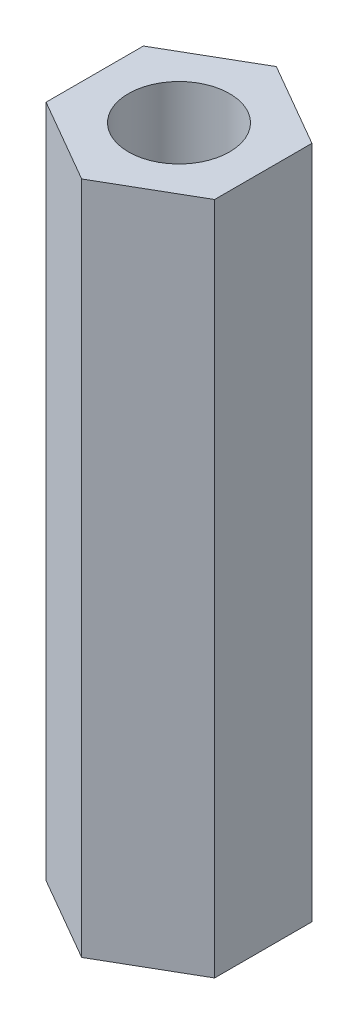
ISO-10303-21;
HEADER;
FILE_DESCRIPTION(('STEP AP214'),'2;1');
FILE_NAME('part.step','',(''),(''),'','','');
FILE_SCHEMA(('AUTOMOTIVE_DESIGN { 1 0 10303 214 1 1 1 1 }'));
ENDSEC;
DATA;
#1=APPLICATION_CONTEXT('core data for automotive mechanical design processes');
#2=APPLICATION_PROTOCOL_DEFINITION('international standard','automotive_design',2000,#1);
#3=PRODUCT_CONTEXT('',#1,'mechanical');
#4=PRODUCT('Part','Part','',(#3));
#5=PRODUCT_RELATED_PRODUCT_CATEGORY('part','',(#4));
#6=PRODUCT_DEFINITION_FORMATION('','',#4);
#7=PRODUCT_DEFINITION_CONTEXT('part definition',#1,'design');
#8=PRODUCT_DEFINITION('design','',#6,#7);
#9=PRODUCT_DEFINITION_SHAPE('','',#8);
#10=(LENGTH_UNIT() NAMED_UNIT(*) SI_UNIT(.MILLI.,.METRE.));
#11=(NAMED_UNIT(*) PLANE_ANGLE_UNIT() SI_UNIT($,.RADIAN.));
#12=(NAMED_UNIT(*) SI_UNIT($,.STERADIAN.) SOLID_ANGLE_UNIT());
#13=UNCERTAINTY_MEASURE_WITH_UNIT(LENGTH_MEASURE(1.E-05),#10,'distance_accuracy_value','');
#14=(GEOMETRIC_REPRESENTATION_CONTEXT(3) GLOBAL_UNCERTAINTY_ASSIGNED_CONTEXT((#13)) GLOBAL_UNIT_ASSIGNED_CONTEXT((#10,
#11,#12)) REPRESENTATION_CONTEXT('',''));
#15=CARTESIAN_POINT('',(0.,0.,0.));
#16=DIRECTION('',(0.,0.,1.));
#17=DIRECTION('',(1.,0.,0.));
#18=AXIS2_PLACEMENT_3D('',#15,#16,#17);
#19=CARTESIAN_POINT('',(-4.99999999999997,40.,2.88675134594819));
#20=DIRECTION('',(0.499999999999995,0.,-0.866025403784442));
#21=DIRECTION('',(-0.866025403784442,0.,-0.499999999999995));
#22=AXIS2_PLACEMENT_3D('',#19,#20,#21);
#23=PLANE('',#22);
#24=DIRECTION('',(0.866025403784442,0.,0.499999999999995));
#25=VECTOR('',#24,1.);
#26=CARTESIAN_POINT('',(-4.99999999999997,0.,2.88675134594819));
#27=LINE('',#26,#25);
#28=CARTESIAN_POINT('',(-4.99999999999997,0.,2.88675134594819));
#29=VERTEX_POINT('',#28);
#30=CARTESIAN_POINT('',(0.,0.,5.77350269189626));
#31=VERTEX_POINT('',#30);
#32=EDGE_CURVE('E117',#29,#31,#27,.T.);
#33=ORIENTED_EDGE('',*,*,#32,.T.);
#34=DIRECTION('',(0.,-1.,0.));
#35=VECTOR('',#34,1.);
#36=CARTESIAN_POINT('',(0.,40.,5.77350269189626));
#37=LINE('',#36,#35);
#38=CARTESIAN_POINT('',(0.,40.,5.77350269189626));
#39=VERTEX_POINT('',#38);
#40=EDGE_CURVE('E11',#39,#31,#37,.T.);
#41=ORIENTED_EDGE('',*,*,#40,.F.);
#42=DIRECTION('',(0.866025403784442,0.,0.499999999999995));
#43=VECTOR('',#42,1.);
#44=CARTESIAN_POINT('',(-4.99999999999997,40.,2.88675134594819));
#45=LINE('',#44,#43);
#46=CARTESIAN_POINT('',(-4.99999999999997,40.,2.88675134594819));
#47=VERTEX_POINT('',#46);
#48=EDGE_CURVE('E128',#47,#39,#45,.T.);
#49=ORIENTED_EDGE('',*,*,#48,.F.);
#50=DIRECTION('',(0.,-1.,0.));
#51=VECTOR('',#50,1.);
#52=CARTESIAN_POINT('',(-4.99999999999997,40.,2.88675134594819));
#53=LINE('',#52,#51);
#54=EDGE_CURVE('E113',#47,#29,#53,.T.);
#55=ORIENTED_EDGE('',*,*,#54,.T.);
#56=EDGE_LOOP('',(#33,#41,#49,#55));
#57=FACE_BOUND('',#56,.T.);
#58=ADVANCED_FACE('F33',(#57),#23,.F.);
#59=CARTESIAN_POINT('',(0.,40.,5.77350269189626));
#60=DIRECTION('',(-0.500000000000001,0.,-0.866025403784438));
#61=DIRECTION('',(-0.866025403784438,0.,0.500000000000001));
#62=AXIS2_PLACEMENT_3D('',#59,#60,#61);
#63=PLANE('',#62);
#64=DIRECTION('',(0.866025403784438,0.,-0.500000000000001));
#65=VECTOR('',#64,1.);
#66=CARTESIAN_POINT('',(0.,0.,5.77350269189626));
#67=LINE('',#66,#65);
#68=CARTESIAN_POINT('',(5.00000000000001,0.,2.88675134594812));
#69=VERTEX_POINT('',#68);
#70=EDGE_CURVE('E120',#31,#69,#67,.T.);
#71=ORIENTED_EDGE('',*,*,#70,.T.);
#72=DIRECTION('',(0.,-1.,0.));
#73=VECTOR('',#72,1.);
#74=CARTESIAN_POINT('',(5.00000000000001,40.,2.88675134594812));
#75=LINE('',#74,#73);
#76=CARTESIAN_POINT('',(5.00000000000001,40.,2.88675134594812));
#77=VERTEX_POINT('',#76);
#78=EDGE_CURVE('E41',#77,#69,#75,.T.);
#79=ORIENTED_EDGE('',*,*,#78,.F.);
#80=DIRECTION('',(0.866025403784438,0.,-0.500000000000001));
#81=VECTOR('',#80,1.);
#82=CARTESIAN_POINT('',(0.,40.,5.77350269189626));
#83=LINE('',#82,#81);
#84=EDGE_CURVE('E86',#39,#77,#83,.T.);
#85=ORIENTED_EDGE('',*,*,#84,.F.);
#86=ORIENTED_EDGE('',*,*,#40,.T.);
#87=EDGE_LOOP('',(#71,#79,#85,#86));
#88=FACE_BOUND('',#87,.T.);
#89=ADVANCED_FACE('F153',(#88),#63,.F.);
#90=CARTESIAN_POINT('',(5.00000000000001,40.,2.88675134594812));
#91=DIRECTION('',(-1.,0.,0.));
#92=DIRECTION('',(0.,0.,1.));
#93=AXIS2_PLACEMENT_3D('',#90,#91,#92);
#94=PLANE('',#93);
#95=DIRECTION('',(0.,0.,-1.));
#96=VECTOR('',#95,1.);
#97=CARTESIAN_POINT('',(5.00000000000001,0.,2.88675134594812));
#98=LINE('',#97,#96);
#99=CARTESIAN_POINT('',(4.99999999999999,0.,-2.88675134594815));
#100=VERTEX_POINT('',#99);
#101=EDGE_CURVE('E123',#69,#100,#98,.T.);
#102=ORIENTED_EDGE('',*,*,#101,.T.);
#103=DIRECTION('',(0.,-1.,0.));
#104=VECTOR('',#103,1.);
#105=CARTESIAN_POINT('',(4.99999999999999,40.,-2.88675134594815));
#106=LINE('',#105,#104);
#107=CARTESIAN_POINT('',(4.99999999999999,40.,-2.88675134594815));
#108=VERTEX_POINT('',#107);
#109=EDGE_CURVE('E108',#108,#100,#106,.T.);
#110=ORIENTED_EDGE('',*,*,#109,.F.);
#111=DIRECTION('',(0.,0.,-1.));
#112=VECTOR('',#111,1.);
#113=CARTESIAN_POINT('',(5.00000000000001,40.,2.88675134594812));
#114=LINE('',#113,#112);
#115=EDGE_CURVE('E99',#77,#108,#114,.T.);
#116=ORIENTED_EDGE('',*,*,#115,.F.);
#117=ORIENTED_EDGE('',*,*,#78,.T.);
#118=EDGE_LOOP('',(#102,#110,#116,#117));
#119=FACE_BOUND('',#118,.T.);
#120=ADVANCED_FACE('F134',(#119),#94,.F.);
#121=CARTESIAN_POINT('',(4.99999999999999,40.,-2.88675134594815));
#122=DIRECTION('',(-0.499999999999995,0.,0.866025403784442));
#123=DIRECTION('',(0.866025403784442,0.,0.499999999999995));
#124=AXIS2_PLACEMENT_3D('',#121,#122,#123);
#125=PLANE('',#124);
#126=DIRECTION('',(-0.866025403784441,0.,-0.499999999999995));
#127=VECTOR('',#126,1.);
#128=CARTESIAN_POINT('',(4.99999999999999,0.,-2.88675134594815));
#129=LINE('',#128,#127);
#130=CARTESIAN_POINT('',(0.,0.,-5.77350269189626));
#131=VERTEX_POINT('',#130);
#132=EDGE_CURVE('E107',#100,#131,#129,.T.);
#133=ORIENTED_EDGE('',*,*,#132,.T.);
#134=DIRECTION('',(0.,-1.,0.));
#135=VECTOR('',#134,1.);
#136=CARTESIAN_POINT('',(0.,40.,-5.77350269189626));
#137=LINE('',#136,#135);
#138=CARTESIAN_POINT('',(0.,40.,-5.77350269189626));
#139=VERTEX_POINT('',#138);
#140=EDGE_CURVE('E104',#139,#131,#137,.T.);
#141=ORIENTED_EDGE('',*,*,#140,.F.);
#142=DIRECTION('',(-0.866025403784441,0.,-0.499999999999995));
#143=VECTOR('',#142,1.);
#144=CARTESIAN_POINT('',(4.99999999999999,40.,-2.88675134594815));
#145=LINE('',#144,#143);
#146=EDGE_CURVE('E93',#108,#139,#145,.T.);
#147=ORIENTED_EDGE('',*,*,#146,.F.);
#148=ORIENTED_EDGE('',*,*,#109,.T.);
#149=EDGE_LOOP('',(#133,#141,#147,#148));
#150=FACE_BOUND('',#149,.T.);
#151=ADVANCED_FACE('F105',(#150),#125,.F.);
#152=CARTESIAN_POINT('',(0.,40.,-5.77350269189626));
#153=DIRECTION('',(0.500000000000007,0.,0.866025403784435));
#154=DIRECTION('',(0.866025403784435,0.,-0.500000000000007));
#155=AXIS2_PLACEMENT_3D('',#152,#153,#154);
#156=PLANE('',#155);
#157=DIRECTION('',(-0.866025403784434,0.,0.500000000000007));
#158=VECTOR('',#157,1.);
#159=CARTESIAN_POINT('',(0.,0.,-5.77350269189626));
#160=LINE('',#159,#158);
#161=CARTESIAN_POINT('',(-5.00000000000003,0.,-2.88675134594808));
#162=VERTEX_POINT('',#161);
#163=EDGE_CURVE('E72',#131,#162,#160,.T.);
#164=ORIENTED_EDGE('',*,*,#163,.T.);
#165=DIRECTION('',(0.,-1.,0.));
#166=VECTOR('',#165,1.);
#167=CARTESIAN_POINT('',(-5.00000000000003,40.,-2.88675134594808));
#168=LINE('',#167,#166);
#169=CARTESIAN_POINT('',(-5.00000000000003,40.,-2.88675134594808));
#170=VERTEX_POINT('',#169);
#171=EDGE_CURVE('E109',#170,#162,#168,.T.);
#172=ORIENTED_EDGE('',*,*,#171,.F.);
#173=DIRECTION('',(-0.866025403784434,0.,0.500000000000007));
#174=VECTOR('',#173,1.);
#175=CARTESIAN_POINT('',(0.,40.,-5.77350269189626));
#176=LINE('',#175,#174);
#177=EDGE_CURVE('E97',#139,#170,#176,.T.);
#178=ORIENTED_EDGE('',*,*,#177,.F.);
#179=ORIENTED_EDGE('',*,*,#140,.T.);
#180=EDGE_LOOP('',(#164,#172,#178,#179));
#181=FACE_BOUND('',#180,.T.);
#182=ADVANCED_FACE('F111',(#181),#156,.F.);
#183=CARTESIAN_POINT('',(-5.00000000000003,40.,-2.88675134594808));
#184=DIRECTION('',(1.,0.,0.));
#185=DIRECTION('',(0.,0.,-1.));
#186=AXIS2_PLACEMENT_3D('',#183,#184,#185);
#187=PLANE('',#186);
#188=DIRECTION('',(0.,0.,1.));
#189=VECTOR('',#188,1.);
#190=CARTESIAN_POINT('',(-5.00000000000003,0.,-2.88675134594808));
#191=LINE('',#190,#189);
#192=EDGE_CURVE('E78',#162,#29,#191,.T.);
#193=ORIENTED_EDGE('',*,*,#192,.T.);
#194=ORIENTED_EDGE('',*,*,#54,.F.);
#195=DIRECTION('',(0.,0.,1.));
#196=VECTOR('',#195,1.);
#197=CARTESIAN_POINT('',(-5.00000000000003,40.,-2.88675134594808));
#198=LINE('',#197,#196);
#199=EDGE_CURVE('E49',#170,#47,#198,.T.);
#200=ORIENTED_EDGE('',*,*,#199,.F.);
#201=ORIENTED_EDGE('',*,*,#171,.T.);
#202=EDGE_LOOP('',(#193,#194,#200,#201));
#203=FACE_BOUND('',#202,.T.);
#204=ADVANCED_FACE('F141',(#203),#187,.F.);
#205=CARTESIAN_POINT('',(0.,40.,0.));
#206=DIRECTION('',(0.,1.,0.));
#207=DIRECTION('',(0.,0.,1.));
#208=AXIS2_PLACEMENT_3D('',#205,#206,#207);
#209=PLANE('',#208);
#210=CARTESIAN_POINT('',(0.,40.,0.));
#211=DIRECTION('',(0.,1.,0.));
#212=DIRECTION('',(0.,0.,1.));
#213=AXIS2_PLACEMENT_3D('',#210,#211,#212);
#214=CIRCLE('',#213,3.);
#215=CARTESIAN_POINT('',(0.,40.,3.));
#216=VERTEX_POINT('',#215);
#217=EDGE_CURVE('E237',#216,#216,#214,.T.);
#218=ORIENTED_EDGE('',*,*,#217,.F.);
#219=EDGE_LOOP('',(#218));
#220=FACE_BOUND('',#219,.T.);
#221=ORIENTED_EDGE('',*,*,#48,.T.);
#222=ORIENTED_EDGE('',*,*,#84,.T.);
#223=ORIENTED_EDGE('',*,*,#115,.T.);
#224=ORIENTED_EDGE('',*,*,#146,.T.);
#225=ORIENTED_EDGE('',*,*,#177,.T.);
#226=ORIENTED_EDGE('',*,*,#199,.T.);
#227=EDGE_LOOP('',(#221,#222,#223,#224,#225,#226));
#228=FACE_BOUND('',#227,.T.);
#229=ADVANCED_FACE('F95',(#220,#228),#209,.T.);
#230=CARTESIAN_POINT('',(0.,0.,0.));
#231=DIRECTION('',(0.,1.,0.));
#232=DIRECTION('',(0.,0.,1.));
#233=AXIS2_PLACEMENT_3D('',#230,#231,#232);
#234=PLANE('',#233);
#235=CARTESIAN_POINT('',(0.,0.,0.));
#236=DIRECTION('',(0.,-1.,0.));
#237=DIRECTION('',(0.,0.,-1.));
#238=AXIS2_PLACEMENT_3D('',#235,#236,#237);
#239=CIRCLE('',#238,3.);
#240=CARTESIAN_POINT('',(0.,0.,-3.));
#241=VERTEX_POINT('',#240);
#242=EDGE_CURVE('E236',#241,#241,#239,.T.);
#243=ORIENTED_EDGE('',*,*,#242,.F.);
#244=EDGE_LOOP('',(#243));
#245=FACE_BOUND('',#244,.T.);
#246=ORIENTED_EDGE('',*,*,#32,.F.);
#247=ORIENTED_EDGE('',*,*,#192,.F.);
#248=ORIENTED_EDGE('',*,*,#163,.F.);
#249=ORIENTED_EDGE('',*,*,#132,.F.);
#250=ORIENTED_EDGE('',*,*,#101,.F.);
#251=ORIENTED_EDGE('',*,*,#70,.F.);
#252=EDGE_LOOP('',(#246,#247,#248,#249,#250,#251));
#253=FACE_BOUND('',#252,.T.);
#254=ADVANCED_FACE('F137',(#245,#253),#234,.F.);
#255=CARTESIAN_POINT('',(0.,12.,0.));
#256=DIRECTION('',(0.,-1.,0.));
#257=DIRECTION('',(0.,0.,-1.));
#258=AXIS2_PLACEMENT_3D('',#255,#256,#257);
#259=CYLINDRICAL_SURFACE('',#258,3.);
#260=CARTESIAN_POINT('',(0.,12.,0.));
#261=DIRECTION('',(0.,-1.,0.));
#262=DIRECTION('',(0.,0.,-1.));
#263=AXIS2_PLACEMENT_3D('',#260,#261,#262);
#264=CIRCLE('',#263,3.);
#265=CARTESIAN_POINT('',(0.,12.,-3.));
#266=VERTEX_POINT('',#265);
#267=EDGE_CURVE('E121',#266,#266,#264,.T.);
#268=ORIENTED_EDGE('',*,*,#267,.F.);
#269=EDGE_LOOP('',(#268));
#270=FACE_BOUND('',#269,.T.);
#271=ORIENTED_EDGE('',*,*,#242,.T.);
#272=EDGE_LOOP('',(#271));
#273=FACE_BOUND('',#272,.T.);
#274=ADVANCED_FACE('F185',(#270,#273),#259,.F.);
#275=CARTESIAN_POINT('',(0.,12.,0.));
#276=DIRECTION('',(0.,-1.,0.));
#277=DIRECTION('',(0.,0.,-1.));
#278=AXIS2_PLACEMENT_3D('',#275,#276,#277);
#279=PLANE('',#278);
#280=ORIENTED_EDGE('',*,*,#267,.T.);
#281=EDGE_LOOP('',(#280));
#282=FACE_BOUND('',#281,.T.);
#283=ADVANCED_FACE('F194',(#282),#279,.T.);
#284=CARTESIAN_POINT('',(0.,28.,0.));
#285=DIRECTION('',(0.,1.,0.));
#286=DIRECTION('',(0.,0.,1.));
#287=AXIS2_PLACEMENT_3D('',#284,#285,#286);
#288=CYLINDRICAL_SURFACE('',#287,3.);
#289=CARTESIAN_POINT('',(0.,28.,0.));
#290=DIRECTION('',(0.,1.,0.));
#291=DIRECTION('',(0.,0.,1.));
#292=AXIS2_PLACEMENT_3D('',#289,#290,#291);
#293=CIRCLE('',#292,3.);
#294=CARTESIAN_POINT('',(0.,28.,3.));
#295=VERTEX_POINT('',#294);
#296=EDGE_CURVE('E235',#295,#295,#293,.T.);
#297=ORIENTED_EDGE('',*,*,#296,.F.);
#298=EDGE_LOOP('',(#297));
#299=FACE_BOUND('',#298,.T.);
#300=ORIENTED_EDGE('',*,*,#217,.T.);
#301=EDGE_LOOP('',(#300));
#302=FACE_BOUND('',#301,.T.);
#303=ADVANCED_FACE('F204',(#299,#302),#288,.F.);
#304=CARTESIAN_POINT('',(0.,28.,0.));
#305=DIRECTION('',(0.,1.,0.));
#306=DIRECTION('',(0.,0.,1.));
#307=AXIS2_PLACEMENT_3D('',#304,#305,#306);
#308=PLANE('',#307);
#309=ORIENTED_EDGE('',*,*,#296,.T.);
#310=EDGE_LOOP('',(#309));
#311=FACE_BOUND('',#310,.T.);
#312=ADVANCED_FACE('F219',(#311),#308,.T.);
#313=CLOSED_SHELL('',(#58,#89,#120,#151,#182,#204,#229,#254,#274,#283,#303,#312));
#314=MANIFOLD_SOLID_BREP('B2',#313);
#315=ADVANCED_BREP_SHAPE_REPRESENTATION('',(#18,#314),#14);
#316=SHAPE_DEFINITION_REPRESENTATION(#9,#315);
ENDSEC;
END-ISO-10303-21;
